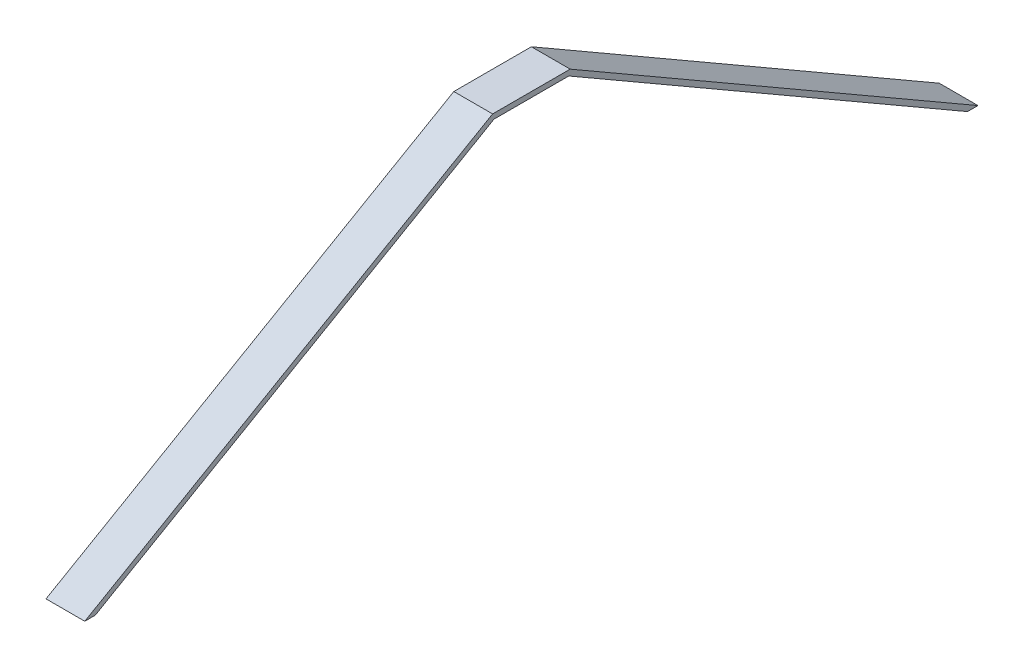
ISO-10303-21;
HEADER;
FILE_DESCRIPTION(('STEP AP214'),'2;1');
FILE_NAME('part.step','',(''),(''),'','','');
FILE_SCHEMA(('AUTOMOTIVE_DESIGN { 1 0 10303 214 1 1 1 1 }'));
ENDSEC;
DATA;
#1=APPLICATION_CONTEXT('core data for automotive mechanical design processes');
#2=APPLICATION_PROTOCOL_DEFINITION('international standard','automotive_design',2000,#1);
#3=PRODUCT_CONTEXT('',#1,'mechanical');
#4=PRODUCT('Part','Part','',(#3));
#5=PRODUCT_RELATED_PRODUCT_CATEGORY('part','',(#4));
#6=PRODUCT_DEFINITION_FORMATION('','',#4);
#7=PRODUCT_DEFINITION_CONTEXT('part definition',#1,'design');
#8=PRODUCT_DEFINITION('design','',#6,#7);
#9=PRODUCT_DEFINITION_SHAPE('','',#8);
#10=(LENGTH_UNIT() NAMED_UNIT(*) SI_UNIT(.MILLI.,.METRE.));
#11=(NAMED_UNIT(*) PLANE_ANGLE_UNIT() SI_UNIT($,.RADIAN.));
#12=(NAMED_UNIT(*) SI_UNIT($,.STERADIAN.) SOLID_ANGLE_UNIT());
#13=UNCERTAINTY_MEASURE_WITH_UNIT(LENGTH_MEASURE(1.E-05),#10,'distance_accuracy_value','');
#14=(GEOMETRIC_REPRESENTATION_CONTEXT(3) GLOBAL_UNCERTAINTY_ASSIGNED_CONTEXT((#13)) GLOBAL_UNIT_ASSIGNED_CONTEXT((#10,
#11,#12)) REPRESENTATION_CONTEXT('',''));
#15=CARTESIAN_POINT('',(0.,0.,0.));
#16=DIRECTION('',(0.,0.,1.));
#17=DIRECTION('',(1.,0.,0.));
#18=AXIS2_PLACEMENT_3D('',#15,#16,#17);
#19=CARTESIAN_POINT('',(155.,772.866968793293,-446.214952480579));
#20=DIRECTION('',(0.,0.866025403784438,-0.500000000000001));
#21=DIRECTION('',(0.,0.500000000000001,0.866025403784438));
#22=AXIS2_PLACEMENT_3D('',#19,#20,#21);
#23=PLANE('',#22);
#24=DIRECTION('',(0.,-0.500000000000001,-0.866025403784438));
#25=VECTOR('',#24,1.);
#26=CARTESIAN_POINT('',(0.,772.866968793293,-446.214952480579));
#27=LINE('',#26,#25);
#28=CARTESIAN_POINT('',(0.,941.,-155.));
#29=VERTEX_POINT('',#28);
#30=CARTESIAN_POINT('',(0.,0.,-1784.85980992231));
#31=VERTEX_POINT('',#30);
#32=EDGE_CURVE('E141',#29,#31,#27,.T.);
#33=ORIENTED_EDGE('',*,*,#32,.F.);
#34=DIRECTION('',(-1.,0.,0.));
#35=VECTOR('',#34,1.);
#36=CARTESIAN_POINT('',(155.,941.,-155.));
#37=LINE('',#36,#35);
#38=CARTESIAN_POINT('',(155.,941.,-155.));
#39=VERTEX_POINT('',#38);
#40=EDGE_CURVE('E11',#39,#29,#37,.T.);
#41=ORIENTED_EDGE('',*,*,#40,.F.);
#42=DIRECTION('',(0.,-0.500000000000001,-0.866025403784438));
#43=VECTOR('',#42,1.);
#44=CARTESIAN_POINT('',(155.,772.866968793293,-446.214952480579));
#45=LINE('',#44,#43);
#46=CARTESIAN_POINT('',(155.,0.,-1784.85980992231));
#47=VERTEX_POINT('',#46);
#48=EDGE_CURVE('E166',#39,#47,#45,.T.);
#49=ORIENTED_EDGE('',*,*,#48,.T.);
#50=DIRECTION('',(-1.,0.,0.));
#51=VECTOR('',#50,1.);
#52=CARTESIAN_POINT('',(155.,0.,-1784.85980992231));
#53=LINE('',#52,#51);
#54=EDGE_CURVE('E60',#47,#31,#53,.T.);
#55=ORIENTED_EDGE('',*,*,#54,.T.);
#56=EDGE_LOOP('',(#33,#41,#49,#55));
#57=FACE_BOUND('',#56,.T.);
#58=ADVANCED_FACE('F43',(#57),#23,.T.);
#59=CARTESIAN_POINT('',(155.,941.,0.));
#60=DIRECTION('',(0.,1.,0.));
#61=DIRECTION('',(0.,0.,1.));
#62=AXIS2_PLACEMENT_3D('',#59,#60,#61);
#63=PLANE('',#62);
#64=DIRECTION('',(0.,0.,-1.));
#65=VECTOR('',#64,1.);
#66=CARTESIAN_POINT('',(0.,941.,0.));
#67=LINE('',#66,#65);
#68=CARTESIAN_POINT('',(0.,941.,155.));
#69=VERTEX_POINT('',#68);
#70=EDGE_CURVE('E144',#69,#29,#67,.T.);
#71=ORIENTED_EDGE('',*,*,#70,.F.);
#72=DIRECTION('',(-1.,0.,0.));
#73=VECTOR('',#72,1.);
#74=CARTESIAN_POINT('',(155.,941.,155.));
#75=LINE('',#74,#73);
#76=CARTESIAN_POINT('',(155.,941.,155.));
#77=VERTEX_POINT('',#76);
#78=EDGE_CURVE('E52',#77,#69,#75,.T.);
#79=ORIENTED_EDGE('',*,*,#78,.F.);
#80=DIRECTION('',(0.,0.,-1.));
#81=VECTOR('',#80,1.);
#82=CARTESIAN_POINT('',(155.,941.,0.));
#83=LINE('',#82,#81);
#84=EDGE_CURVE('E196',#77,#39,#83,.T.);
#85=ORIENTED_EDGE('',*,*,#84,.T.);
#86=ORIENTED_EDGE('',*,*,#40,.T.);
#87=EDGE_LOOP('',(#71,#79,#85,#86));
#88=FACE_BOUND('',#87,.T.);
#89=ADVANCED_FACE('F195',(#88),#63,.T.);
#90=CARTESIAN_POINT('',(155.,772.866968793293,446.214952480579));
#91=DIRECTION('',(0.,-0.866025403784438,-0.500000000000001));
#92=DIRECTION('',(0.,0.500000000000001,-0.866025403784438));
#93=AXIS2_PLACEMENT_3D('',#90,#91,#92);
#94=PLANE('',#93);
#95=DIRECTION('',(0.,-0.500000000000001,0.866025403784438));
#96=VECTOR('',#95,1.);
#97=CARTESIAN_POINT('',(0.,772.866968793293,446.214952480579));
#98=LINE('',#97,#96);
#99=CARTESIAN_POINT('',(0.,-2.22044604925031E-13,1784.85980992231));
#100=VERTEX_POINT('',#99);
#101=EDGE_CURVE('E148',#69,#100,#98,.T.);
#102=ORIENTED_EDGE('',*,*,#101,.T.);
#103=DIRECTION('',(-1.,0.,0.));
#104=VECTOR('',#103,1.);
#105=CARTESIAN_POINT('',(155.,-2.22044604925031E-13,1784.85980992231));
#106=LINE('',#105,#104);
#107=CARTESIAN_POINT('',(155.,-2.22044604925031E-13,1784.85980992231));
#108=VERTEX_POINT('',#107);
#109=EDGE_CURVE('E177',#108,#100,#106,.T.);
#110=ORIENTED_EDGE('',*,*,#109,.F.);
#111=DIRECTION('',(0.,-0.500000000000001,0.866025403784438));
#112=VECTOR('',#111,1.);
#113=CARTESIAN_POINT('',(155.,772.866968793293,446.214952480579));
#114=LINE('',#113,#112);
#115=EDGE_CURVE('E186',#77,#108,#114,.T.);
#116=ORIENTED_EDGE('',*,*,#115,.F.);
#117=ORIENTED_EDGE('',*,*,#78,.T.);
#118=EDGE_LOOP('',(#102,#110,#116,#117));
#119=FACE_BOUND('',#118,.T.);
#120=ADVANCED_FACE('F184',(#119),#94,.F.);
#121=CARTESIAN_POINT('',(155.,0.,0.));
#122=DIRECTION('',(0.,1.,0.));
#123=DIRECTION('',(0.,0.,1.));
#124=AXIS2_PLACEMENT_3D('',#121,#122,#123);
#125=PLANE('',#124);
#126=DIRECTION('',(0.,0.,-1.));
#127=VECTOR('',#126,1.);
#128=CARTESIAN_POINT('',(0.,0.,0.));
#129=LINE('',#128,#127);
#130=CARTESIAN_POINT('',(0.,0.,1742.85980992231));
#131=VERTEX_POINT('',#130);
#132=EDGE_CURVE('E151',#100,#131,#129,.T.);
#133=ORIENTED_EDGE('',*,*,#132,.T.);
#134=DIRECTION('',(-1.,0.,0.));
#135=VECTOR('',#134,1.);
#136=CARTESIAN_POINT('',(155.,0.,1742.85980992231));
#137=LINE('',#136,#135);
#138=CARTESIAN_POINT('',(155.,0.,1742.85980992231));
#139=VERTEX_POINT('',#138);
#140=EDGE_CURVE('E173',#139,#131,#137,.T.);
#141=ORIENTED_EDGE('',*,*,#140,.F.);
#142=DIRECTION('',(0.,0.,-1.));
#143=VECTOR('',#142,1.);
#144=CARTESIAN_POINT('',(155.,0.,0.));
#145=LINE('',#144,#143);
#146=EDGE_CURVE('E291',#108,#139,#145,.T.);
#147=ORIENTED_EDGE('',*,*,#146,.F.);
#148=ORIENTED_EDGE('',*,*,#109,.T.);
#149=EDGE_LOOP('',(#133,#141,#147,#148));
#150=FACE_BOUND('',#149,.T.);
#151=ADVANCED_FACE('F214',(#150),#125,.F.);
#152=CARTESIAN_POINT('',(155.,754.68043531382,435.714952480579));
#153=DIRECTION('',(0.,0.866025403784438,0.500000000000001));
#154=DIRECTION('',(0.,-0.500000000000001,0.866025403784438));
#155=AXIS2_PLACEMENT_3D('',#152,#153,#154);
#156=PLANE('',#155);
#157=DIRECTION('',(0.,0.500000000000001,-0.866025403784438));
#158=VECTOR('',#157,1.);
#159=CARTESIAN_POINT('',(0.,754.68043531382,435.714952480579));
#160=LINE('',#159,#158);
#161=CARTESIAN_POINT('',(0.,920.,149.373066958947));
#162=VERTEX_POINT('',#161);
#163=EDGE_CURVE('E154',#131,#162,#160,.T.);
#164=ORIENTED_EDGE('',*,*,#163,.T.);
#165=DIRECTION('',(-1.,0.,0.));
#166=VECTOR('',#165,1.);
#167=CARTESIAN_POINT('',(155.,920.,149.373066958947));
#168=LINE('',#167,#166);
#169=CARTESIAN_POINT('',(155.,920.,149.373066958947));
#170=VERTEX_POINT('',#169);
#171=EDGE_CURVE('E131',#170,#162,#168,.T.);
#172=ORIENTED_EDGE('',*,*,#171,.F.);
#173=DIRECTION('',(0.,0.500000000000001,-0.866025403784438));
#174=VECTOR('',#173,1.);
#175=CARTESIAN_POINT('',(155.,754.68043531382,435.714952480579));
#176=LINE('',#175,#174);
#177=EDGE_CURVE('E117',#139,#170,#176,.T.);
#178=ORIENTED_EDGE('',*,*,#177,.F.);
#179=ORIENTED_EDGE('',*,*,#140,.T.);
#180=EDGE_LOOP('',(#164,#172,#178,#179));
#181=FACE_BOUND('',#180,.T.);
#182=ADVANCED_FACE('F219',(#181),#156,.F.);
#183=CARTESIAN_POINT('',(155.,920.,0.));
#184=DIRECTION('',(0.,1.,0.));
#185=DIRECTION('',(0.,0.,1.));
#186=AXIS2_PLACEMENT_3D('',#183,#184,#185);
#187=PLANE('',#186);
#188=DIRECTION('',(0.,0.,-1.));
#189=VECTOR('',#188,1.);
#190=CARTESIAN_POINT('',(0.,920.,0.));
#191=LINE('',#190,#189);
#192=CARTESIAN_POINT('',(0.,920.,-149.373066958947));
#193=VERTEX_POINT('',#192);
#194=EDGE_CURVE('E127',#162,#193,#191,.T.);
#195=ORIENTED_EDGE('',*,*,#194,.T.);
#196=DIRECTION('',(-1.,0.,0.));
#197=VECTOR('',#196,1.);
#198=CARTESIAN_POINT('',(155.,920.,-149.373066958947));
#199=LINE('',#198,#197);
#200=CARTESIAN_POINT('',(155.,920.,-149.373066958947));
#201=VERTEX_POINT('',#200);
#202=EDGE_CURVE('E124',#201,#193,#199,.T.);
#203=ORIENTED_EDGE('',*,*,#202,.F.);
#204=DIRECTION('',(0.,0.,-1.));
#205=VECTOR('',#204,1.);
#206=CARTESIAN_POINT('',(155.,920.,0.));
#207=LINE('',#206,#205);
#208=EDGE_CURVE('E110',#170,#201,#207,.T.);
#209=ORIENTED_EDGE('',*,*,#208,.F.);
#210=ORIENTED_EDGE('',*,*,#171,.T.);
#211=EDGE_LOOP('',(#195,#203,#209,#210));
#212=FACE_BOUND('',#211,.T.);
#213=ADVANCED_FACE('F125',(#212),#187,.F.);
#214=CARTESIAN_POINT('',(155.,754.68043531382,-435.714952480579));
#215=DIRECTION('',(0.,-0.866025403784438,0.500000000000001));
#216=DIRECTION('',(0.,-0.500000000000001,-0.866025403784438));
#217=AXIS2_PLACEMENT_3D('',#214,#215,#216);
#218=PLANE('',#217);
#219=DIRECTION('',(0.,0.500000000000001,0.866025403784438));
#220=VECTOR('',#219,1.);
#221=CARTESIAN_POINT('',(0.,754.68043531382,-435.714952480579));
#222=LINE('',#221,#220);
#223=CARTESIAN_POINT('',(0.,1.11022302462516E-13,-1742.85980992231));
#224=VERTEX_POINT('',#223);
#225=EDGE_CURVE('E159',#224,#193,#222,.T.);
#226=ORIENTED_EDGE('',*,*,#225,.F.);
#227=DIRECTION('',(-1.,0.,0.));
#228=VECTOR('',#227,1.);
#229=CARTESIAN_POINT('',(155.,1.11022302462516E-13,-1742.85980992231));
#230=LINE('',#229,#228);
#231=CARTESIAN_POINT('',(155.,1.11022302462516E-13,-1742.85980992231));
#232=VERTEX_POINT('',#231);
#233=EDGE_CURVE('E85',#232,#224,#230,.T.);
#234=ORIENTED_EDGE('',*,*,#233,.F.);
#235=DIRECTION('',(0.,0.500000000000001,0.866025403784438));
#236=VECTOR('',#235,1.);
#237=CARTESIAN_POINT('',(155.,754.68043531382,-435.714952480579));
#238=LINE('',#237,#236);
#239=EDGE_CURVE('E115',#232,#201,#238,.T.);
#240=ORIENTED_EDGE('',*,*,#239,.T.);
#241=ORIENTED_EDGE('',*,*,#202,.T.);
#242=EDGE_LOOP('',(#226,#234,#240,#241));
#243=FACE_BOUND('',#242,.T.);
#244=ADVANCED_FACE('F133',(#243),#218,.T.);
#245=CARTESIAN_POINT('',(155.,0.,0.));
#246=DIRECTION('',(0.,-1.,0.));
#247=DIRECTION('',(0.,0.,-1.));
#248=AXIS2_PLACEMENT_3D('',#245,#246,#247);
#249=PLANE('',#248);
#250=DIRECTION('',(0.,0.,1.));
#251=VECTOR('',#250,1.);
#252=CARTESIAN_POINT('',(0.,0.,0.));
#253=LINE('',#252,#251);
#254=EDGE_CURVE('E162',#31,#224,#253,.T.);
#255=ORIENTED_EDGE('',*,*,#254,.F.);
#256=ORIENTED_EDGE('',*,*,#54,.F.);
#257=DIRECTION('',(0.,0.,1.));
#258=VECTOR('',#257,1.);
#259=CARTESIAN_POINT('',(155.,0.,0.));
#260=LINE('',#259,#258);
#261=EDGE_CURVE('E135',#47,#232,#260,.T.);
#262=ORIENTED_EDGE('',*,*,#261,.T.);
#263=ORIENTED_EDGE('',*,*,#233,.T.);
#264=EDGE_LOOP('',(#255,#256,#262,#263));
#265=FACE_BOUND('',#264,.T.);
#266=ADVANCED_FACE('F197',(#265),#249,.T.);
#267=CARTESIAN_POINT('',(155.,0.,0.));
#268=DIRECTION('',(1.,0.,0.));
#269=DIRECTION('',(0.,0.,-1.));
#270=AXIS2_PLACEMENT_3D('',#267,#268,#269);
#271=PLANE('',#270);
#272=ORIENTED_EDGE('',*,*,#48,.F.);
#273=ORIENTED_EDGE('',*,*,#84,.F.);
#274=ORIENTED_EDGE('',*,*,#115,.T.);
#275=ORIENTED_EDGE('',*,*,#146,.T.);
#276=ORIENTED_EDGE('',*,*,#177,.T.);
#277=ORIENTED_EDGE('',*,*,#208,.T.);
#278=ORIENTED_EDGE('',*,*,#239,.F.);
#279=ORIENTED_EDGE('',*,*,#261,.F.);
#280=EDGE_LOOP('',(#272,#273,#274,#275,#276,#277,#278,#279));
#281=FACE_BOUND('',#280,.T.);
#282=ADVANCED_FACE('F112',(#281),#271,.T.);
#283=CARTESIAN_POINT('',(0.,0.,0.));
#284=DIRECTION('',(1.,0.,0.));
#285=DIRECTION('',(0.,0.,-1.));
#286=AXIS2_PLACEMENT_3D('',#283,#284,#285);
#287=PLANE('',#286);
#288=ORIENTED_EDGE('',*,*,#32,.T.);
#289=ORIENTED_EDGE('',*,*,#254,.T.);
#290=ORIENTED_EDGE('',*,*,#225,.T.);
#291=ORIENTED_EDGE('',*,*,#194,.F.);
#292=ORIENTED_EDGE('',*,*,#163,.F.);
#293=ORIENTED_EDGE('',*,*,#132,.F.);
#294=ORIENTED_EDGE('',*,*,#101,.F.);
#295=ORIENTED_EDGE('',*,*,#70,.T.);
#296=EDGE_LOOP('',(#288,#289,#290,#291,#292,#293,#294,#295));
#297=FACE_BOUND('',#296,.T.);
#298=ADVANCED_FACE('F193',(#297),#287,.F.);
#299=CLOSED_SHELL('',(#58,#89,#120,#151,#182,#213,#244,#266,#282,#298));
#300=MANIFOLD_SOLID_BREP('B2',#299);
#301=ADVANCED_BREP_SHAPE_REPRESENTATION('',(#18,#300),#14);
#302=SHAPE_DEFINITION_REPRESENTATION(#9,#301);
ENDSEC;
END-ISO-10303-21;
